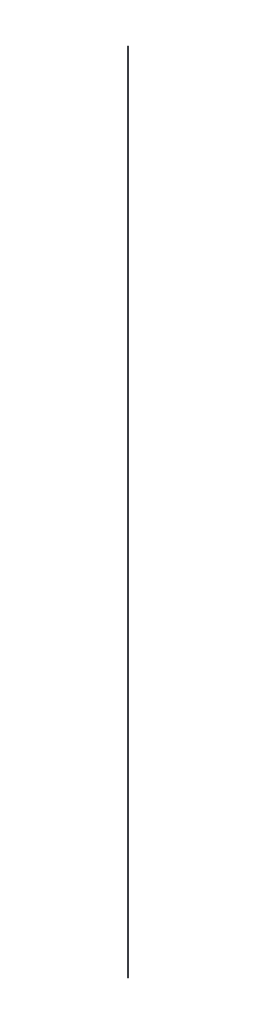
ISO-10303-21;
HEADER;
FILE_DESCRIPTION(('STEP AP214'),'2;1');
FILE_NAME('part.step','',(''),(''),'','','');
FILE_SCHEMA(('AUTOMOTIVE_DESIGN { 1 0 10303 214 1 1 1 1 }'));
ENDSEC;
DATA;
#1=APPLICATION_CONTEXT('core data for automotive mechanical design processes');
#2=APPLICATION_PROTOCOL_DEFINITION('international standard','automotive_design',2000,#1);
#3=PRODUCT_CONTEXT('',#1,'mechanical');
#4=PRODUCT('Part','Part','',(#3));
#5=PRODUCT_RELATED_PRODUCT_CATEGORY('part','',(#4));
#6=PRODUCT_DEFINITION_FORMATION('','',#4);
#7=PRODUCT_DEFINITION_CONTEXT('part definition',#1,'design');
#8=PRODUCT_DEFINITION('design','',#6,#7);
#9=PRODUCT_DEFINITION_SHAPE('','',#8);
#10=(LENGTH_UNIT() NAMED_UNIT(*) SI_UNIT(.MILLI.,.METRE.));
#11=(NAMED_UNIT(*) PLANE_ANGLE_UNIT() SI_UNIT($,.RADIAN.));
#12=(NAMED_UNIT(*) SI_UNIT($,.STERADIAN.) SOLID_ANGLE_UNIT());
#13=UNCERTAINTY_MEASURE_WITH_UNIT(LENGTH_MEASURE(1.E-05),#10,'distance_accuracy_value','');
#14=(GEOMETRIC_REPRESENTATION_CONTEXT(3) GLOBAL_UNCERTAINTY_ASSIGNED_CONTEXT((#13)) GLOBAL_UNIT_ASSIGNED_CONTEXT((#10,
#11,#12)) REPRESENTATION_CONTEXT('',''));
#15=CARTESIAN_POINT('',(0.,0.,0.));
#16=DIRECTION('',(0.,0.,1.));
#17=DIRECTION('',(1.,0.,0.));
#18=AXIS2_PLACEMENT_3D('',#15,#16,#17);
#19=CARTESIAN_POINT('',(0.,250.,0.));
#20=DIRECTION('',(0.,-1.,0.));
#21=DIRECTION('',(0.,0.,-1.));
#22=AXIS2_PLACEMENT_3D('',#19,#20,#21);
#23=CYLINDRICAL_SURFACE('',#22,0.121522631476718);
#24=CARTESIAN_POINT('',(0.,250.,0.));
#25=DIRECTION('',(0.,1.,0.));
#26=DIRECTION('',(0.,0.,1.));
#27=AXIS2_PLACEMENT_3D('',#24,#25,#26);
#28=CIRCLE('',#27,0.121522631476718);
#29=CARTESIAN_POINT('',(0.,250.,0.121522631476718));
#30=VERTEX_POINT('',#29);
#31=EDGE_CURVE('E10',#30,#30,#28,.T.);
#32=ORIENTED_EDGE('',*,*,#31,.F.);
#33=EDGE_LOOP('',(#32));
#34=FACE_BOUND('',#33,.T.);
#35=CARTESIAN_POINT('',(0.,-250.,0.));
#36=DIRECTION('',(0.,1.,0.));
#37=DIRECTION('',(0.,0.,1.));
#38=AXIS2_PLACEMENT_3D('',#35,#36,#37);
#39=CIRCLE('',#38,0.121522631476718);
#40=CARTESIAN_POINT('',(0.,-250.,0.121522631476718));
#41=VERTEX_POINT('',#40);
#42=EDGE_CURVE('E34',#41,#41,#39,.T.);
#43=ORIENTED_EDGE('',*,*,#42,.T.);
#44=EDGE_LOOP('',(#43));
#45=FACE_BOUND('',#44,.T.);
#46=ADVANCED_FACE('F31',(#34,#45),#23,.T.);
#47=CARTESIAN_POINT('',(0.,250.,0.));
#48=DIRECTION('',(0.,1.,0.));
#49=DIRECTION('',(0.,0.,1.));
#50=AXIS2_PLACEMENT_3D('',#47,#48,#49);
#51=PLANE('',#50);
#52=ORIENTED_EDGE('',*,*,#31,.T.);
#53=EDGE_LOOP('',(#52));
#54=FACE_BOUND('',#53,.T.);
#55=ADVANCED_FACE('F46',(#54),#51,.T.);
#56=CARTESIAN_POINT('',(0.,-250.,0.));
#57=DIRECTION('',(0.,1.,0.));
#58=DIRECTION('',(0.,0.,1.));
#59=AXIS2_PLACEMENT_3D('',#56,#57,#58);
#60=PLANE('',#59);
#61=ORIENTED_EDGE('',*,*,#42,.F.);
#62=EDGE_LOOP('',(#61));
#63=FACE_BOUND('',#62,.T.);
#64=ADVANCED_FACE('F44',(#63),#60,.F.);
#65=CLOSED_SHELL('',(#46,#55,#64));
#66=MANIFOLD_SOLID_BREP('B2',#65);
#67=ADVANCED_BREP_SHAPE_REPRESENTATION('',(#18,#66),#14);
#68=SHAPE_DEFINITION_REPRESENTATION(#9,#67);
ENDSEC;
END-ISO-10303-21;
